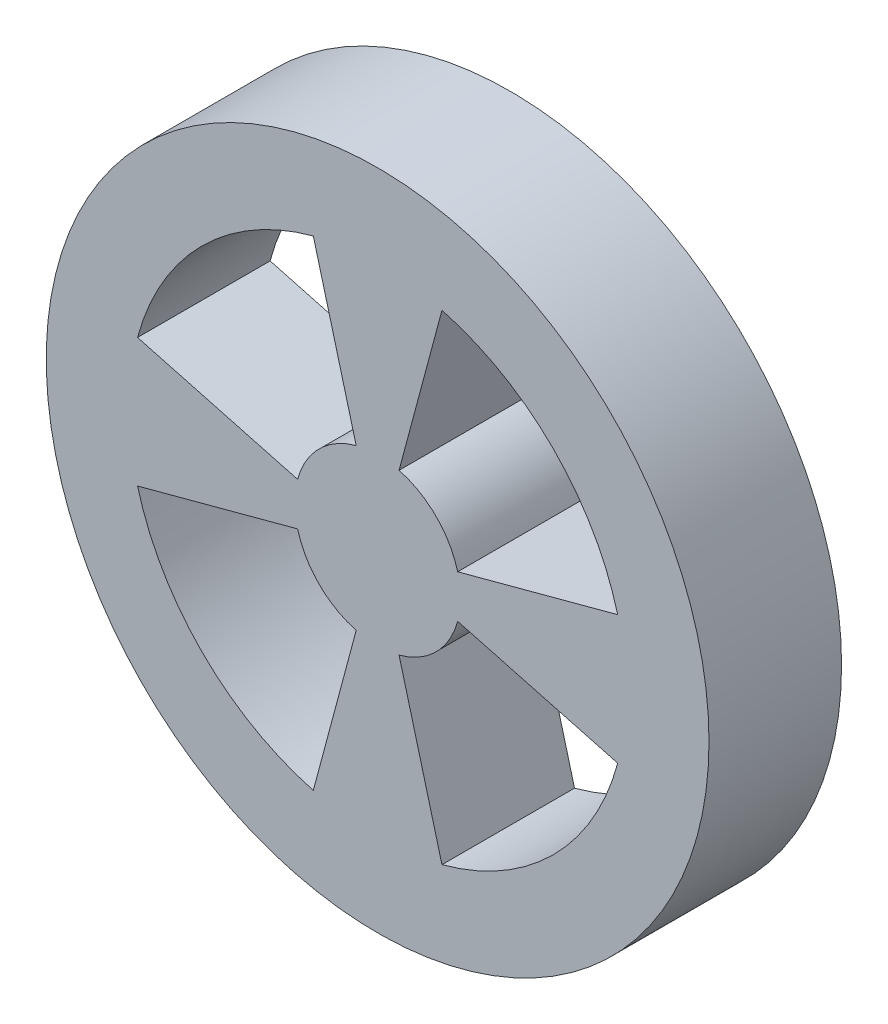
ISO-10303-21;
HEADER;
FILE_DESCRIPTION(('STEP AP214'),'2;1');
FILE_NAME('part.step','',(''),(''),'','','');
FILE_SCHEMA(('AUTOMOTIVE_DESIGN { 1 0 10303 214 1 1 1 1 }'));
ENDSEC;
DATA;
#1=APPLICATION_CONTEXT('core data for automotive mechanical design processes');
#2=APPLICATION_PROTOCOL_DEFINITION('international standard','automotive_design',2000,#1);
#3=PRODUCT_CONTEXT('',#1,'mechanical');
#4=PRODUCT('Part','Part','',(#3));
#5=PRODUCT_RELATED_PRODUCT_CATEGORY('part','',(#4));
#6=PRODUCT_DEFINITION_FORMATION('','',#4);
#7=PRODUCT_DEFINITION_CONTEXT('part definition',#1,'design');
#8=PRODUCT_DEFINITION('design','',#6,#7);
#9=PRODUCT_DEFINITION_SHAPE('','',#8);
#10=(LENGTH_UNIT() NAMED_UNIT(*) SI_UNIT(.MILLI.,.METRE.));
#11=(NAMED_UNIT(*) PLANE_ANGLE_UNIT() SI_UNIT($,.RADIAN.));
#12=(NAMED_UNIT(*) SI_UNIT($,.STERADIAN.) SOLID_ANGLE_UNIT());
#13=UNCERTAINTY_MEASURE_WITH_UNIT(LENGTH_MEASURE(1.E-05),#10,'distance_accuracy_value','');
#14=(GEOMETRIC_REPRESENTATION_CONTEXT(3) GLOBAL_UNCERTAINTY_ASSIGNED_CONTEXT((#13)) GLOBAL_UNIT_ASSIGNED_CONTEXT((#10,
#11,#12)) REPRESENTATION_CONTEXT('',''));
#15=CARTESIAN_POINT('',(0.,0.,0.));
#16=DIRECTION('',(0.,0.,1.));
#17=DIRECTION('',(1.,0.,0.));
#18=AXIS2_PLACEMENT_3D('',#15,#16,#17);
#19=CARTESIAN_POINT('',(0.,0.,0.4));
#20=DIRECTION('',(0.,0.,1.));
#21=DIRECTION('',(1.,0.,0.));
#22=AXIS2_PLACEMENT_3D('',#19,#20,#21);
#23=PLANE('',#22);
#24=CARTESIAN_POINT('',(0.,0.,0.4));
#25=DIRECTION('',(0.,0.,1.));
#26=DIRECTION('',(1.,0.,0.));
#27=AXIS2_PLACEMENT_3D('',#24,#25,#26);
#28=CIRCLE('',#27,1.);
#29=CARTESIAN_POINT('',(1.,0.,0.4));
#30=VERTEX_POINT('',#29);
#31=EDGE_CURVE('E11',#30,#30,#28,.T.);
#32=ORIENTED_EDGE('',*,*,#31,.T.);
#33=EDGE_LOOP('',(#32));
#34=FACE_BOUND('',#33,.T.);
#35=DIRECTION('',(0.965925826289068,-0.258819045102521,0.));
#36=VECTOR('',#35,1.);
#37=CARTESIAN_POINT('',(-0.724444369716801,0.194114283826891,0.4));
#38=LINE('',#37,#36);
#39=CARTESIAN_POINT('',(-0.724444369716801,0.194114283826891,0.4));
#40=VERTEX_POINT('',#39);
#41=CARTESIAN_POINT('',(-0.241481456572267,0.0647047612756302,0.4));
#42=VERTEX_POINT('',#41);
#43=EDGE_CURVE('E290',#40,#42,#38,.T.);
#44=ORIENTED_EDGE('',*,*,#43,.F.);
#45=CARTESIAN_POINT('',(0.,0.,0.4));
#46=DIRECTION('',(0.,0.,1.));
#47=DIRECTION('',(1.,0.,0.));
#48=AXIS2_PLACEMENT_3D('',#45,#46,#47);
#49=CIRCLE('',#48,0.75);
#50=CARTESIAN_POINT('',(-0.194114283826892,0.724444369716801,0.4));
#51=VERTEX_POINT('',#50);
#52=EDGE_CURVE('E287',#51,#40,#49,.T.);
#53=ORIENTED_EDGE('',*,*,#52,.F.);
#54=DIRECTION('',(-0.258819045102522,0.965925826289068,0.));
#55=VECTOR('',#54,1.);
#56=CARTESIAN_POINT('',(-0.194114283826892,0.724444369716801,0.4));
#57=LINE('',#56,#55);
#58=CARTESIAN_POINT('',(-0.0647047612756304,0.241481456572267,0.4));
#59=VERTEX_POINT('',#58);
#60=EDGE_CURVE('E298',#59,#51,#57,.T.);
#61=ORIENTED_EDGE('',*,*,#60,.F.);
#62=CARTESIAN_POINT('',(0.,0.,0.4));
#63=DIRECTION('',(0.,0.,-1.));
#64=DIRECTION('',(1.,0.,0.));
#65=AXIS2_PLACEMENT_3D('',#62,#63,#64);
#66=CIRCLE('',#65,0.25);
#67=EDGE_CURVE('E294',#42,#59,#66,.T.);
#68=ORIENTED_EDGE('',*,*,#67,.F.);
#69=EDGE_LOOP('',(#44,#53,#61,#68));
#70=FACE_BOUND('',#69,.T.);
#71=DIRECTION('',(-0.258819045102522,-0.965925826289068,0.));
#72=VECTOR('',#71,1.);
#73=CARTESIAN_POINT('',(0.194114283826892,0.724444369716801,0.4));
#74=LINE('',#73,#72);
#75=CARTESIAN_POINT('',(0.194114283826892,0.724444369716801,0.4));
#76=VERTEX_POINT('',#75);
#77=CARTESIAN_POINT('',(0.0647047612756305,0.241481456572267,0.4));
#78=VERTEX_POINT('',#77);
#79=EDGE_CURVE('E247',#76,#78,#74,.T.);
#80=ORIENTED_EDGE('',*,*,#79,.F.);
#81=CARTESIAN_POINT('',(0.,0.,0.4));
#82=DIRECTION('',(0.,0.,1.));
#83=DIRECTION('',(-1.,0.,0.));
#84=AXIS2_PLACEMENT_3D('',#81,#82,#83);
#85=CIRCLE('',#84,0.75);
#86=CARTESIAN_POINT('',(0.724444369716801,0.194114283826891,0.4));
#87=VERTEX_POINT('',#86);
#88=EDGE_CURVE('E244',#87,#76,#85,.T.);
#89=ORIENTED_EDGE('',*,*,#88,.F.);
#90=DIRECTION('',(0.965925826289068,0.258819045102521,0.));
#91=VECTOR('',#90,1.);
#92=CARTESIAN_POINT('',(0.724444369716801,0.194114283826891,0.4));
#93=LINE('',#92,#91);
#94=CARTESIAN_POINT('',(0.241481456572267,0.0647047612756303,0.4));
#95=VERTEX_POINT('',#94);
#96=EDGE_CURVE('E255',#95,#87,#93,.T.);
#97=ORIENTED_EDGE('',*,*,#96,.F.);
#98=CARTESIAN_POINT('',(0.,0.,0.4));
#99=DIRECTION('',(0.,0.,-1.));
#100=DIRECTION('',(-1.,0.,0.));
#101=AXIS2_PLACEMENT_3D('',#98,#99,#100);
#102=CIRCLE('',#101,0.25);
#103=EDGE_CURVE('E251',#78,#95,#102,.T.);
#104=ORIENTED_EDGE('',*,*,#103,.F.);
#105=EDGE_LOOP('',(#80,#89,#97,#104));
#106=FACE_BOUND('',#105,.T.);
#107=DIRECTION('',(-0.965925826289068,0.258819045102521,0.));
#108=VECTOR('',#107,1.);
#109=CARTESIAN_POINT('',(0.724444369716801,-0.194114283826891,0.4));
#110=LINE('',#109,#108);
#111=CARTESIAN_POINT('',(0.724444369716801,-0.194114283826891,0.4));
#112=VERTEX_POINT('',#111);
#113=CARTESIAN_POINT('',(0.241481456572267,-0.0647047612756304,0.4));
#114=VERTEX_POINT('',#113);
#115=EDGE_CURVE('E204',#112,#114,#110,.T.);
#116=ORIENTED_EDGE('',*,*,#115,.F.);
#117=CARTESIAN_POINT('',(0.,0.,0.4));
#118=DIRECTION('',(0.,0.,1.));
#119=DIRECTION('',(1.,0.,0.));
#120=AXIS2_PLACEMENT_3D('',#117,#118,#119);
#121=CIRCLE('',#120,0.75);
#122=CARTESIAN_POINT('',(0.194114283826892,-0.724444369716801,0.4));
#123=VERTEX_POINT('',#122);
#124=EDGE_CURVE('E201',#123,#112,#121,.T.);
#125=ORIENTED_EDGE('',*,*,#124,.F.);
#126=DIRECTION('',(0.258819045102522,-0.965925826289068,0.));
#127=VECTOR('',#126,1.);
#128=CARTESIAN_POINT('',(0.194114283826892,-0.724444369716801,0.4));
#129=LINE('',#128,#127);
#130=CARTESIAN_POINT('',(0.0647047612756305,-0.241481456572267,0.4));
#131=VERTEX_POINT('',#130);
#132=EDGE_CURVE('E212',#131,#123,#129,.T.);
#133=ORIENTED_EDGE('',*,*,#132,.F.);
#134=CARTESIAN_POINT('',(0.,0.,0.4));
#135=DIRECTION('',(0.,0.,-1.));
#136=DIRECTION('',(1.,0.,0.));
#137=AXIS2_PLACEMENT_3D('',#134,#135,#136);
#138=CIRCLE('',#137,0.25);
#139=EDGE_CURVE('E208',#114,#131,#138,.T.);
#140=ORIENTED_EDGE('',*,*,#139,.F.);
#141=EDGE_LOOP('',(#116,#125,#133,#140));
#142=FACE_BOUND('',#141,.T.);
#143=DIRECTION('',(0.258819045102522,0.965925826289068,0.));
#144=VECTOR('',#143,1.);
#145=CARTESIAN_POINT('',(-0.194114283826891,-0.724444369716801,0.4));
#146=LINE('',#145,#144);
#147=CARTESIAN_POINT('',(-0.194114283826891,-0.724444369716801,0.4));
#148=VERTEX_POINT('',#147);
#149=CARTESIAN_POINT('',(-0.0647047612756303,-0.241481456572267,0.4));
#150=VERTEX_POINT('',#149);
#151=EDGE_CURVE('E162',#148,#150,#146,.T.);
#152=ORIENTED_EDGE('',*,*,#151,.F.);
#153=CARTESIAN_POINT('',(0.,0.,0.4));
#154=DIRECTION('',(0.,0.,1.));
#155=DIRECTION('',(-1.,0.,0.));
#156=AXIS2_PLACEMENT_3D('',#153,#154,#155);
#157=CIRCLE('',#156,0.75);
#158=CARTESIAN_POINT('',(-0.724444369716801,-0.194114283826891,0.4));
#159=VERTEX_POINT('',#158);
#160=EDGE_CURVE('E153',#159,#148,#157,.T.);
#161=ORIENTED_EDGE('',*,*,#160,.F.);
#162=DIRECTION('',(-0.965925826289068,-0.258819045102522,0.));
#163=VECTOR('',#162,1.);
#164=CARTESIAN_POINT('',(-0.724444369716801,-0.194114283826891,0.4));
#165=LINE('',#164,#163);
#166=CARTESIAN_POINT('',(-0.241481456572267,-0.0647047612756304,0.4));
#167=VERTEX_POINT('',#166);
#168=EDGE_CURVE('E179',#167,#159,#165,.T.);
#169=ORIENTED_EDGE('',*,*,#168,.F.);
#170=CARTESIAN_POINT('',(0.,0.,0.4));
#171=DIRECTION('',(0.,0.,-1.));
#172=DIRECTION('',(-1.,0.,0.));
#173=AXIS2_PLACEMENT_3D('',#170,#171,#172);
#174=CIRCLE('',#173,0.25);
#175=EDGE_CURVE('E175',#150,#167,#174,.T.);
#176=ORIENTED_EDGE('',*,*,#175,.F.);
#177=EDGE_LOOP('',(#152,#161,#169,#176));
#178=FACE_BOUND('',#177,.T.);
#179=ADVANCED_FACE('F39',(#34,#70,#106,#142,#178),#23,.T.);
#180=CARTESIAN_POINT('',(0.,0.,0.));
#181=DIRECTION('',(0.,0.,1.));
#182=DIRECTION('',(1.,0.,0.));
#183=AXIS2_PLACEMENT_3D('',#180,#181,#182);
#184=PLANE('',#183);
#185=CARTESIAN_POINT('',(0.,0.,0.));
#186=DIRECTION('',(0.,0.,1.));
#187=DIRECTION('',(1.,0.,0.));
#188=AXIS2_PLACEMENT_3D('',#185,#186,#187);
#189=CIRCLE('',#188,0.75);
#190=CARTESIAN_POINT('',(0.194114283826892,-0.724444369716801,0.));
#191=VERTEX_POINT('',#190);
#192=CARTESIAN_POINT('',(0.724444369716801,-0.194114283826891,0.));
#193=VERTEX_POINT('',#192);
#194=EDGE_CURVE('E171',#191,#193,#189,.T.);
#195=ORIENTED_EDGE('',*,*,#194,.T.);
#196=DIRECTION('',(-0.965925826289068,0.258819045102521,0.));
#197=VECTOR('',#196,1.);
#198=CARTESIAN_POINT('',(0.724444369716801,-0.194114283826891,0.));
#199=LINE('',#198,#197);
#200=CARTESIAN_POINT('',(0.241481456572267,-0.0647047612756304,0.));
#201=VERTEX_POINT('',#200);
#202=EDGE_CURVE('E219',#193,#201,#199,.T.);
#203=ORIENTED_EDGE('',*,*,#202,.T.);
#204=CARTESIAN_POINT('',(0.,0.,0.));
#205=DIRECTION('',(0.,0.,-1.));
#206=DIRECTION('',(1.,0.,0.));
#207=AXIS2_PLACEMENT_3D('',#204,#205,#206);
#208=CIRCLE('',#207,0.25);
#209=CARTESIAN_POINT('',(0.0647047612756305,-0.241481456572267,0.));
#210=VERTEX_POINT('',#209);
#211=EDGE_CURVE('E223',#201,#210,#208,.T.);
#212=ORIENTED_EDGE('',*,*,#211,.T.);
#213=DIRECTION('',(0.258819045102522,-0.965925826289068,0.));
#214=VECTOR('',#213,1.);
#215=CARTESIAN_POINT('',(0.194114283826892,-0.724444369716801,0.));
#216=LINE('',#215,#214);
#217=EDGE_CURVE('E205',#210,#191,#216,.T.);
#218=ORIENTED_EDGE('',*,*,#217,.T.);
#219=EDGE_LOOP('',(#195,#203,#212,#218));
#220=FACE_BOUND('',#219,.T.);
#221=CARTESIAN_POINT('',(0.,0.,0.));
#222=DIRECTION('',(0.,0.,1.));
#223=DIRECTION('',(1.,0.,0.));
#224=AXIS2_PLACEMENT_3D('',#221,#222,#223);
#225=CIRCLE('',#224,0.75);
#226=CARTESIAN_POINT('',(-0.194114283826892,0.724444369716801,0.));
#227=VERTEX_POINT('',#226);
#228=CARTESIAN_POINT('',(-0.724444369716801,0.194114283826891,0.));
#229=VERTEX_POINT('',#228);
#230=EDGE_CURVE('E286',#227,#229,#225,.T.);
#231=ORIENTED_EDGE('',*,*,#230,.T.);
#232=DIRECTION('',(0.965925826289068,-0.258819045102521,0.));
#233=VECTOR('',#232,1.);
#234=CARTESIAN_POINT('',(-0.724444369716801,0.194114283826891,0.));
#235=LINE('',#234,#233);
#236=CARTESIAN_POINT('',(-0.241481456572267,0.0647047612756302,0.));
#237=VERTEX_POINT('',#236);
#238=EDGE_CURVE('E305',#229,#237,#235,.T.);
#239=ORIENTED_EDGE('',*,*,#238,.T.);
#240=CARTESIAN_POINT('',(0.,0.,0.));
#241=DIRECTION('',(0.,0.,-1.));
#242=DIRECTION('',(1.,0.,0.));
#243=AXIS2_PLACEMENT_3D('',#240,#241,#242);
#244=CIRCLE('',#243,0.25);
#245=CARTESIAN_POINT('',(-0.0647047612756304,0.241481456572267,0.));
#246=VERTEX_POINT('',#245);
#247=EDGE_CURVE('E309',#237,#246,#244,.T.);
#248=ORIENTED_EDGE('',*,*,#247,.T.);
#249=DIRECTION('',(-0.258819045102522,0.965925826289068,0.));
#250=VECTOR('',#249,1.);
#251=CARTESIAN_POINT('',(-0.194114283826892,0.724444369716801,0.));
#252=LINE('',#251,#250);
#253=EDGE_CURVE('E291',#246,#227,#252,.T.);
#254=ORIENTED_EDGE('',*,*,#253,.T.);
#255=EDGE_LOOP('',(#231,#239,#248,#254));
#256=FACE_BOUND('',#255,.T.);
#257=CARTESIAN_POINT('',(0.,0.,0.));
#258=DIRECTION('',(0.,0.,1.));
#259=DIRECTION('',(1.,0.,0.));
#260=AXIS2_PLACEMENT_3D('',#257,#258,#259);
#261=CIRCLE('',#260,1.);
#262=CARTESIAN_POINT('',(1.,0.,0.));
#263=VERTEX_POINT('',#262);
#264=EDGE_CURVE('E43',#263,#263,#261,.T.);
#265=ORIENTED_EDGE('',*,*,#264,.F.);
#266=EDGE_LOOP('',(#265));
#267=FACE_BOUND('',#266,.T.);
#268=CARTESIAN_POINT('',(0.,0.,0.));
#269=DIRECTION('',(0.,0.,1.));
#270=DIRECTION('',(-1.,0.,0.));
#271=AXIS2_PLACEMENT_3D('',#268,#269,#270);
#272=CIRCLE('',#271,0.75);
#273=CARTESIAN_POINT('',(0.724444369716801,0.194114283826891,0.));
#274=VERTEX_POINT('',#273);
#275=CARTESIAN_POINT('',(0.194114283826892,0.724444369716801,0.));
#276=VERTEX_POINT('',#275);
#277=EDGE_CURVE('E243',#274,#276,#272,.T.);
#278=ORIENTED_EDGE('',*,*,#277,.T.);
#279=DIRECTION('',(-0.258819045102522,-0.965925826289068,0.));
#280=VECTOR('',#279,1.);
#281=CARTESIAN_POINT('',(0.194114283826892,0.724444369716801,0.));
#282=LINE('',#281,#280);
#283=CARTESIAN_POINT('',(0.0647047612756305,0.241481456572267,0.));
#284=VERTEX_POINT('',#283);
#285=EDGE_CURVE('E262',#276,#284,#282,.T.);
#286=ORIENTED_EDGE('',*,*,#285,.T.);
#287=CARTESIAN_POINT('',(0.,0.,0.));
#288=DIRECTION('',(0.,0.,-1.));
#289=DIRECTION('',(-1.,0.,0.));
#290=AXIS2_PLACEMENT_3D('',#287,#288,#289);
#291=CIRCLE('',#290,0.25);
#292=CARTESIAN_POINT('',(0.241481456572267,0.0647047612756303,0.));
#293=VERTEX_POINT('',#292);
#294=EDGE_CURVE('E266',#284,#293,#291,.T.);
#295=ORIENTED_EDGE('',*,*,#294,.T.);
#296=DIRECTION('',(0.965925826289068,0.258819045102521,0.));
#297=VECTOR('',#296,1.);
#298=CARTESIAN_POINT('',(0.724444369716801,0.194114283826891,0.));
#299=LINE('',#298,#297);
#300=EDGE_CURVE('E248',#293,#274,#299,.T.);
#301=ORIENTED_EDGE('',*,*,#300,.T.);
#302=EDGE_LOOP('',(#278,#286,#295,#301));
#303=FACE_BOUND('',#302,.T.);
#304=CARTESIAN_POINT('',(0.,0.,0.));
#305=DIRECTION('',(0.,0.,1.));
#306=DIRECTION('',(-1.,0.,0.));
#307=AXIS2_PLACEMENT_3D('',#304,#305,#306);
#308=CIRCLE('',#307,0.75);
#309=CARTESIAN_POINT('',(-0.724444369716801,-0.194114283826891,0.));
#310=VERTEX_POINT('',#309);
#311=CARTESIAN_POINT('',(-0.194114283826891,-0.724444369716801,0.));
#312=VERTEX_POINT('',#311);
#313=EDGE_CURVE('E63',#310,#312,#308,.T.);
#314=ORIENTED_EDGE('',*,*,#313,.T.);
#315=DIRECTION('',(0.258819045102522,0.965925826289068,0.));
#316=VECTOR('',#315,1.);
#317=CARTESIAN_POINT('',(-0.194114283826891,-0.724444369716801,0.));
#318=LINE('',#317,#316);
#319=CARTESIAN_POINT('',(-0.0647047612756303,-0.241481456572267,0.));
#320=VERTEX_POINT('',#319);
#321=EDGE_CURVE('E169',#312,#320,#318,.T.);
#322=ORIENTED_EDGE('',*,*,#321,.T.);
#323=CARTESIAN_POINT('',(0.,0.,0.));
#324=DIRECTION('',(0.,0.,-1.));
#325=DIRECTION('',(-1.,0.,0.));
#326=AXIS2_PLACEMENT_3D('',#323,#324,#325);
#327=CIRCLE('',#326,0.25);
#328=CARTESIAN_POINT('',(-0.241481456572267,-0.0647047612756304,0.));
#329=VERTEX_POINT('',#328);
#330=EDGE_CURVE('E188',#320,#329,#327,.T.);
#331=ORIENTED_EDGE('',*,*,#330,.T.);
#332=DIRECTION('',(-0.965925826289068,-0.258819045102522,0.));
#333=VECTOR('',#332,1.);
#334=CARTESIAN_POINT('',(-0.724444369716801,-0.194114283826891,0.));
#335=LINE('',#334,#333);
#336=EDGE_CURVE('E163',#329,#310,#335,.T.);
#337=ORIENTED_EDGE('',*,*,#336,.T.);
#338=EDGE_LOOP('',(#314,#322,#331,#337));
#339=FACE_BOUND('',#338,.T.);
#340=ADVANCED_FACE('F335',(#220,#256,#267,#303,#339),#184,.F.);
#341=CARTESIAN_POINT('',(0.,0.,0.4));
#342=DIRECTION('',(0.,0.,-1.));
#343=DIRECTION('',(-1.,0.,0.));
#344=AXIS2_PLACEMENT_3D('',#341,#342,#343);
#345=CYLINDRICAL_SURFACE('',#344,1.);
#346=ORIENTED_EDGE('',*,*,#31,.F.);
#347=EDGE_LOOP('',(#346));
#348=FACE_BOUND('',#347,.T.);
#349=ORIENTED_EDGE('',*,*,#264,.T.);
#350=EDGE_LOOP('',(#349));
#351=FACE_BOUND('',#350,.T.);
#352=ADVANCED_FACE('F41',(#348,#351),#345,.T.);
#353=CARTESIAN_POINT('',(0.,0.,0.4));
#354=DIRECTION('',(0.,0.,-1.));
#355=DIRECTION('',(-1.,0.,0.));
#356=AXIS2_PLACEMENT_3D('',#353,#354,#355);
#357=CYLINDRICAL_SURFACE('',#356,0.75);
#358=ORIENTED_EDGE('',*,*,#230,.F.);
#359=DIRECTION('',(0.,0.,-1.));
#360=VECTOR('',#359,1.);
#361=CARTESIAN_POINT('',(-0.194114283826892,0.724444369716801,0.4));
#362=LINE('',#361,#360);
#363=EDGE_CURVE('E301',#51,#227,#362,.T.);
#364=ORIENTED_EDGE('',*,*,#363,.F.);
#365=ORIENTED_EDGE('',*,*,#52,.T.);
#366=DIRECTION('',(0.,0.,-1.));
#367=VECTOR('',#366,1.);
#368=CARTESIAN_POINT('',(-0.724444369716801,0.194114283826891,0.4));
#369=LINE('',#368,#367);
#370=EDGE_CURVE('E325',#40,#229,#369,.T.);
#371=ORIENTED_EDGE('',*,*,#370,.T.);
#372=EDGE_LOOP('',(#358,#364,#365,#371));
#373=FACE_BOUND('',#372,.T.);
#374=ADVANCED_FACE('F357',(#373),#357,.F.);
#375=CARTESIAN_POINT('',(-0.724444369716801,0.194114283826891,0.4));
#376=DIRECTION('',(0.258819045102521,0.965925826289068,0.));
#377=DIRECTION('',(-0.965925826289068,0.258819045102521,0.));
#378=AXIS2_PLACEMENT_3D('',#375,#376,#377);
#379=PLANE('',#378);
#380=ORIENTED_EDGE('',*,*,#238,.F.);
#381=ORIENTED_EDGE('',*,*,#370,.F.);
#382=ORIENTED_EDGE('',*,*,#43,.T.);
#383=DIRECTION('',(0.,0.,-1.));
#384=VECTOR('',#383,1.);
#385=CARTESIAN_POINT('',(-0.241481456572267,0.0647047612756302,0.4));
#386=LINE('',#385,#384);
#387=EDGE_CURVE('E322',#42,#237,#386,.T.);
#388=ORIENTED_EDGE('',*,*,#387,.T.);
#389=EDGE_LOOP('',(#380,#381,#382,#388));
#390=FACE_BOUND('',#389,.T.);
#391=ADVANCED_FACE('F360',(#390),#379,.T.);
#392=CARTESIAN_POINT('',(0.,0.,0.4));
#393=DIRECTION('',(0.,0.,-1.));
#394=DIRECTION('',(-1.,0.,0.));
#395=AXIS2_PLACEMENT_3D('',#392,#393,#394);
#396=CYLINDRICAL_SURFACE('',#395,0.25);
#397=ORIENTED_EDGE('',*,*,#247,.F.);
#398=ORIENTED_EDGE('',*,*,#387,.F.);
#399=ORIENTED_EDGE('',*,*,#67,.T.);
#400=DIRECTION('',(0.,0.,-1.));
#401=VECTOR('',#400,1.);
#402=CARTESIAN_POINT('',(-0.0647047612756304,0.241481456572267,0.4));
#403=LINE('',#402,#401);
#404=EDGE_CURVE('E319',#59,#246,#403,.T.);
#405=ORIENTED_EDGE('',*,*,#404,.T.);
#406=EDGE_LOOP('',(#397,#398,#399,#405));
#407=FACE_BOUND('',#406,.T.);
#408=ADVANCED_FACE('F363',(#407),#396,.T.);
#409=CARTESIAN_POINT('',(-0.194114283826892,0.724444369716801,0.4));
#410=DIRECTION('',(-0.965925826289068,-0.258819045102522,0.));
#411=DIRECTION('',(0.258819045102522,-0.965925826289068,0.));
#412=AXIS2_PLACEMENT_3D('',#409,#410,#411);
#413=PLANE('',#412);
#414=ORIENTED_EDGE('',*,*,#253,.F.);
#415=ORIENTED_EDGE('',*,*,#404,.F.);
#416=ORIENTED_EDGE('',*,*,#60,.T.);
#417=ORIENTED_EDGE('',*,*,#363,.T.);
#418=EDGE_LOOP('',(#414,#415,#416,#417));
#419=FACE_BOUND('',#418,.T.);
#420=ADVANCED_FACE('F367',(#419),#413,.T.);
#421=CARTESIAN_POINT('',(0.,0.,0.4));
#422=DIRECTION('',(0.,0.,-1.));
#423=DIRECTION('',(-1.,0.,0.));
#424=AXIS2_PLACEMENT_3D('',#421,#422,#423);
#425=CYLINDRICAL_SURFACE('',#424,0.75);
#426=ORIENTED_EDGE('',*,*,#277,.F.);
#427=DIRECTION('',(0.,0.,-1.));
#428=VECTOR('',#427,1.);
#429=CARTESIAN_POINT('',(0.724444369716801,0.194114283826891,0.4));
#430=LINE('',#429,#428);
#431=EDGE_CURVE('E258',#87,#274,#430,.T.);
#432=ORIENTED_EDGE('',*,*,#431,.F.);
#433=ORIENTED_EDGE('',*,*,#88,.T.);
#434=DIRECTION('',(0.,0.,-1.));
#435=VECTOR('',#434,1.);
#436=CARTESIAN_POINT('',(0.194114283826892,0.724444369716801,0.4));
#437=LINE('',#436,#435);
#438=EDGE_CURVE('E282',#76,#276,#437,.T.);
#439=ORIENTED_EDGE('',*,*,#438,.T.);
#440=EDGE_LOOP('',(#426,#432,#433,#439));
#441=FACE_BOUND('',#440,.T.);
#442=ADVANCED_FACE('F371',(#441),#425,.F.);
#443=CARTESIAN_POINT('',(0.194114283826892,0.724444369716801,0.4));
#444=DIRECTION('',(0.965925826289068,-0.258819045102522,0.));
#445=DIRECTION('',(0.258819045102522,0.965925826289068,0.));
#446=AXIS2_PLACEMENT_3D('',#443,#444,#445);
#447=PLANE('',#446);
#448=ORIENTED_EDGE('',*,*,#285,.F.);
#449=ORIENTED_EDGE('',*,*,#438,.F.);
#450=ORIENTED_EDGE('',*,*,#79,.T.);
#451=DIRECTION('',(0.,0.,-1.));
#452=VECTOR('',#451,1.);
#453=CARTESIAN_POINT('',(0.0647047612756305,0.241481456572267,0.4));
#454=LINE('',#453,#452);
#455=EDGE_CURVE('E279',#78,#284,#454,.T.);
#456=ORIENTED_EDGE('',*,*,#455,.T.);
#457=EDGE_LOOP('',(#448,#449,#450,#456));
#458=FACE_BOUND('',#457,.T.);
#459=ADVANCED_FACE('F375',(#458),#447,.T.);
#460=CARTESIAN_POINT('',(0.,0.,0.4));
#461=DIRECTION('',(0.,0.,-1.));
#462=DIRECTION('',(-1.,0.,0.));
#463=AXIS2_PLACEMENT_3D('',#460,#461,#462);
#464=CYLINDRICAL_SURFACE('',#463,0.25);
#465=ORIENTED_EDGE('',*,*,#294,.F.);
#466=ORIENTED_EDGE('',*,*,#455,.F.);
#467=ORIENTED_EDGE('',*,*,#103,.T.);
#468=DIRECTION('',(0.,0.,-1.));
#469=VECTOR('',#468,1.);
#470=CARTESIAN_POINT('',(0.241481456572267,0.0647047612756303,0.4));
#471=LINE('',#470,#469);
#472=EDGE_CURVE('E276',#95,#293,#471,.T.);
#473=ORIENTED_EDGE('',*,*,#472,.T.);
#474=EDGE_LOOP('',(#465,#466,#467,#473));
#475=FACE_BOUND('',#474,.T.);
#476=ADVANCED_FACE('F379',(#475),#464,.T.);
#477=CARTESIAN_POINT('',(0.724444369716801,0.194114283826891,0.4));
#478=DIRECTION('',(-0.258819045102521,0.965925826289068,0.));
#479=DIRECTION('',(-0.965925826289068,-0.258819045102521,0.));
#480=AXIS2_PLACEMENT_3D('',#477,#478,#479);
#481=PLANE('',#480);
#482=ORIENTED_EDGE('',*,*,#300,.F.);
#483=ORIENTED_EDGE('',*,*,#472,.F.);
#484=ORIENTED_EDGE('',*,*,#96,.T.);
#485=ORIENTED_EDGE('',*,*,#431,.T.);
#486=EDGE_LOOP('',(#482,#483,#484,#485));
#487=FACE_BOUND('',#486,.T.);
#488=ADVANCED_FACE('F383',(#487),#481,.T.);
#489=CARTESIAN_POINT('',(0.,0.,0.4));
#490=DIRECTION('',(0.,0.,-1.));
#491=DIRECTION('',(-1.,0.,0.));
#492=AXIS2_PLACEMENT_3D('',#489,#490,#491);
#493=CYLINDRICAL_SURFACE('',#492,0.75);
#494=ORIENTED_EDGE('',*,*,#194,.F.);
#495=DIRECTION('',(0.,0.,-1.));
#496=VECTOR('',#495,1.);
#497=CARTESIAN_POINT('',(0.194114283826892,-0.724444369716801,0.4));
#498=LINE('',#497,#496);
#499=EDGE_CURVE('E215',#123,#191,#498,.T.);
#500=ORIENTED_EDGE('',*,*,#499,.F.);
#501=ORIENTED_EDGE('',*,*,#124,.T.);
#502=DIRECTION('',(0.,0.,-1.));
#503=VECTOR('',#502,1.);
#504=CARTESIAN_POINT('',(0.724444369716801,-0.194114283826891,0.4));
#505=LINE('',#504,#503);
#506=EDGE_CURVE('E239',#112,#193,#505,.T.);
#507=ORIENTED_EDGE('',*,*,#506,.T.);
#508=EDGE_LOOP('',(#494,#500,#501,#507));
#509=FACE_BOUND('',#508,.T.);
#510=ADVANCED_FACE('F387',(#509),#493,.F.);
#511=CARTESIAN_POINT('',(0.724444369716801,-0.194114283826891,0.4));
#512=DIRECTION('',(-0.258819045102521,-0.965925826289068,0.));
#513=DIRECTION('',(0.965925826289068,-0.258819045102521,0.));
#514=AXIS2_PLACEMENT_3D('',#511,#512,#513);
#515=PLANE('',#514);
#516=ORIENTED_EDGE('',*,*,#202,.F.);
#517=ORIENTED_EDGE('',*,*,#506,.F.);
#518=ORIENTED_EDGE('',*,*,#115,.T.);
#519=DIRECTION('',(0.,0.,-1.));
#520=VECTOR('',#519,1.);
#521=CARTESIAN_POINT('',(0.241481456572267,-0.0647047612756304,0.4));
#522=LINE('',#521,#520);
#523=EDGE_CURVE('E236',#114,#201,#522,.T.);
#524=ORIENTED_EDGE('',*,*,#523,.T.);
#525=EDGE_LOOP('',(#516,#517,#518,#524));
#526=FACE_BOUND('',#525,.T.);
#527=ADVANCED_FACE('F391',(#526),#515,.T.);
#528=CARTESIAN_POINT('',(0.,0.,0.4));
#529=DIRECTION('',(0.,0.,-1.));
#530=DIRECTION('',(-1.,0.,0.));
#531=AXIS2_PLACEMENT_3D('',#528,#529,#530);
#532=CYLINDRICAL_SURFACE('',#531,0.25);
#533=ORIENTED_EDGE('',*,*,#211,.F.);
#534=ORIENTED_EDGE('',*,*,#523,.F.);
#535=ORIENTED_EDGE('',*,*,#139,.T.);
#536=DIRECTION('',(0.,0.,-1.));
#537=VECTOR('',#536,1.);
#538=CARTESIAN_POINT('',(0.0647047612756305,-0.241481456572267,0.4));
#539=LINE('',#538,#537);
#540=EDGE_CURVE('E233',#131,#210,#539,.T.);
#541=ORIENTED_EDGE('',*,*,#540,.T.);
#542=EDGE_LOOP('',(#533,#534,#535,#541));
#543=FACE_BOUND('',#542,.T.);
#544=ADVANCED_FACE('F395',(#543),#532,.T.);
#545=CARTESIAN_POINT('',(0.194114283826892,-0.724444369716801,0.4));
#546=DIRECTION('',(0.965925826289068,0.258819045102522,0.));
#547=DIRECTION('',(-0.258819045102522,0.965925826289068,0.));
#548=AXIS2_PLACEMENT_3D('',#545,#546,#547);
#549=PLANE('',#548);
#550=ORIENTED_EDGE('',*,*,#217,.F.);
#551=ORIENTED_EDGE('',*,*,#540,.F.);
#552=ORIENTED_EDGE('',*,*,#132,.T.);
#553=ORIENTED_EDGE('',*,*,#499,.T.);
#554=EDGE_LOOP('',(#550,#551,#552,#553));
#555=FACE_BOUND('',#554,.T.);
#556=ADVANCED_FACE('F399',(#555),#549,.T.);
#557=CARTESIAN_POINT('',(0.,0.,0.4));
#558=DIRECTION('',(0.,0.,-1.));
#559=DIRECTION('',(-1.,0.,0.));
#560=AXIS2_PLACEMENT_3D('',#557,#558,#559);
#561=CYLINDRICAL_SURFACE('',#560,0.75);
#562=ORIENTED_EDGE('',*,*,#313,.F.);
#563=DIRECTION('',(0.,0.,-1.));
#564=VECTOR('',#563,1.);
#565=CARTESIAN_POINT('',(-0.724444369716801,-0.194114283826891,0.4));
#566=LINE('',#565,#564);
#567=EDGE_CURVE('E157',#159,#310,#566,.T.);
#568=ORIENTED_EDGE('',*,*,#567,.F.);
#569=ORIENTED_EDGE('',*,*,#160,.T.);
#570=DIRECTION('',(0.,0.,-1.));
#571=VECTOR('',#570,1.);
#572=CARTESIAN_POINT('',(-0.194114283826891,-0.724444369716801,0.4));
#573=LINE('',#572,#571);
#574=EDGE_CURVE('E156',#148,#312,#573,.T.);
#575=ORIENTED_EDGE('',*,*,#574,.T.);
#576=EDGE_LOOP('',(#562,#568,#569,#575));
#577=FACE_BOUND('',#576,.T.);
#578=ADVANCED_FACE('F155',(#577),#561,.F.);
#579=CARTESIAN_POINT('',(-0.194114283826891,-0.724444369716801,0.4));
#580=DIRECTION('',(-0.965925826289068,0.258819045102522,0.));
#581=DIRECTION('',(-0.258819045102522,-0.965925826289068,0.));
#582=AXIS2_PLACEMENT_3D('',#579,#580,#581);
#583=PLANE('',#582);
#584=ORIENTED_EDGE('',*,*,#321,.F.);
#585=ORIENTED_EDGE('',*,*,#574,.F.);
#586=ORIENTED_EDGE('',*,*,#151,.T.);
#587=DIRECTION('',(0.,0.,-1.));
#588=VECTOR('',#587,1.);
#589=CARTESIAN_POINT('',(-0.0647047612756303,-0.241481456572267,0.4));
#590=LINE('',#589,#588);
#591=EDGE_CURVE('E172',#150,#320,#590,.T.);
#592=ORIENTED_EDGE('',*,*,#591,.T.);
#593=EDGE_LOOP('',(#584,#585,#586,#592));
#594=FACE_BOUND('',#593,.T.);
#595=ADVANCED_FACE('F166',(#594),#583,.T.);
#596=CARTESIAN_POINT('',(0.,0.,0.4));
#597=DIRECTION('',(0.,0.,-1.));
#598=DIRECTION('',(-1.,0.,0.));
#599=AXIS2_PLACEMENT_3D('',#596,#597,#598);
#600=CYLINDRICAL_SURFACE('',#599,0.25);
#601=ORIENTED_EDGE('',*,*,#330,.F.);
#602=ORIENTED_EDGE('',*,*,#591,.F.);
#603=ORIENTED_EDGE('',*,*,#175,.T.);
#604=DIRECTION('',(0.,0.,-1.));
#605=VECTOR('',#604,1.);
#606=CARTESIAN_POINT('',(-0.241481456572267,-0.0647047612756304,0.4));
#607=LINE('',#606,#605);
#608=EDGE_CURVE('E55',#167,#329,#607,.T.);
#609=ORIENTED_EDGE('',*,*,#608,.T.);
#610=EDGE_LOOP('',(#601,#602,#603,#609));
#611=FACE_BOUND('',#610,.T.);
#612=ADVANCED_FACE('F343',(#611),#600,.T.);
#613=CARTESIAN_POINT('',(-0.724444369716801,-0.194114283826891,0.4));
#614=DIRECTION('',(0.258819045102522,-0.965925826289068,0.));
#615=DIRECTION('',(0.965925826289068,0.258819045102522,0.));
#616=AXIS2_PLACEMENT_3D('',#613,#614,#615);
#617=PLANE('',#616);
#618=ORIENTED_EDGE('',*,*,#336,.F.);
#619=ORIENTED_EDGE('',*,*,#608,.F.);
#620=ORIENTED_EDGE('',*,*,#168,.T.);
#621=ORIENTED_EDGE('',*,*,#567,.T.);
#622=EDGE_LOOP('',(#618,#619,#620,#621));
#623=FACE_BOUND('',#622,.T.);
#624=ADVANCED_FACE('F341',(#623),#617,.T.);
#625=CLOSED_SHELL('',(#179,#340,#352,#374,#391,#408,#420,#442,#459,#476,#488,#510,#527,#544,
#556,#578,#595,#612,#624));
#626=MANIFOLD_SOLID_BREP('B2',#625);
#627=ADVANCED_BREP_SHAPE_REPRESENTATION('',(#18,#626),#14);
#628=SHAPE_DEFINITION_REPRESENTATION(#9,#627);
ENDSEC;
END-ISO-10303-21;
